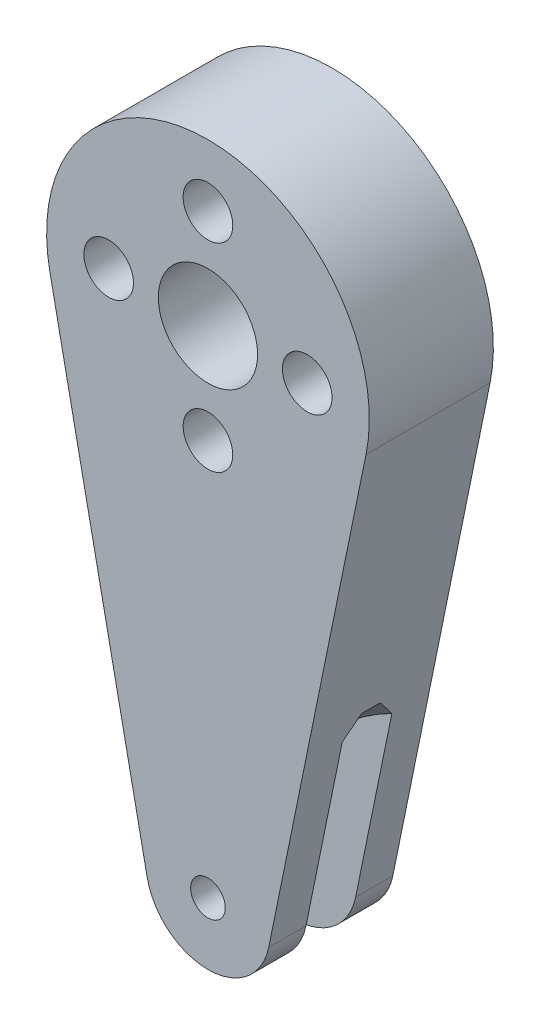
ISO-10303-21;
HEADER;
FILE_DESCRIPTION(('STEP AP214'),'2;1');
FILE_NAME('part.step','',(''),(''),'','','');
FILE_SCHEMA(('AUTOMOTIVE_DESIGN { 1 0 10303 214 1 1 1 1 }'));
ENDSEC;
DATA;
#1=APPLICATION_CONTEXT('core data for automotive mechanical design processes');
#2=APPLICATION_PROTOCOL_DEFINITION('international standard','automotive_design',2000,#1);
#3=PRODUCT_CONTEXT('',#1,'mechanical');
#4=PRODUCT('Part','Part','',(#3));
#5=PRODUCT_RELATED_PRODUCT_CATEGORY('part','',(#4));
#6=PRODUCT_DEFINITION_FORMATION('','',#4);
#7=PRODUCT_DEFINITION_CONTEXT('part definition',#1,'design');
#8=PRODUCT_DEFINITION('design','',#6,#7);
#9=PRODUCT_DEFINITION_SHAPE('','',#8);
#10=(LENGTH_UNIT() NAMED_UNIT(*) SI_UNIT(.MILLI.,.METRE.));
#11=(NAMED_UNIT(*) PLANE_ANGLE_UNIT() SI_UNIT($,.RADIAN.));
#12=(NAMED_UNIT(*) SI_UNIT($,.STERADIAN.) SOLID_ANGLE_UNIT());
#13=UNCERTAINTY_MEASURE_WITH_UNIT(LENGTH_MEASURE(1.E-05),#10,'distance_accuracy_value','');
#14=(GEOMETRIC_REPRESENTATION_CONTEXT(3) GLOBAL_UNCERTAINTY_ASSIGNED_CONTEXT((#13)) GLOBAL_UNIT_ASSIGNED_CONTEXT((#10,
#11,#12)) REPRESENTATION_CONTEXT('',''));
#15=CARTESIAN_POINT('',(0.,0.,0.));
#16=DIRECTION('',(0.,0.,1.));
#17=DIRECTION('',(1.,0.,0.));
#18=AXIS2_PLACEMENT_3D('',#15,#16,#17);
#19=CARTESIAN_POINT('',(4.89858223113876,-40.9243281720762,5.));
#20=DIRECTION('',(-0.979716446227753,0.200388834496492,0.));
#21=DIRECTION('',(-0.200388834496492,-0.979716446227753,0.));
#22=AXIS2_PLACEMENT_3D('',#19,#20,#21);
#23=PLANE('',#22);
#24=DIRECTION('',(0.200388834496492,0.979716446227753,0.));
#25=VECTOR('',#24,1.);
#26=CARTESIAN_POINT('',(4.89858223113876,-40.9243281720762,-2.));
#27=LINE('',#26,#25);
#28=CARTESIAN_POINT('',(4.89858223113876,-40.9243281720762,-2.));
#29=VERTEX_POINT('',#28);
#30=CARTESIAN_POINT('',(7.82050502514721,-26.6388225794583,-2.));
#31=VERTEX_POINT('',#30);
#32=EDGE_CURVE('E153',#29,#31,#27,.T.);
#33=ORIENTED_EDGE('',*,*,#32,.F.);
#34=DIRECTION('',(0.,0.,-1.));
#35=VECTOR('',#34,1.);
#36=CARTESIAN_POINT('',(4.89858223113876,-40.9243281720762,5.));
#37=LINE('',#36,#35);
#38=CARTESIAN_POINT('',(4.89858223113876,-40.9243281720762,-5.));
#39=VERTEX_POINT('',#38);
#40=EDGE_CURVE('E252',#29,#39,#37,.T.);
#41=ORIENTED_EDGE('',*,*,#40,.T.);
#42=DIRECTION('',(0.200388834496492,0.979716446227753,0.));
#43=VECTOR('',#42,1.);
#44=CARTESIAN_POINT('',(4.89858223113876,-40.9243281720762,-5.));
#45=LINE('',#44,#43);
#46=CARTESIAN_POINT('',(12.7363138009608,-2.6050548484544,-5.));
#47=VERTEX_POINT('',#46);
#48=EDGE_CURVE('E230',#39,#47,#45,.T.);
#49=ORIENTED_EDGE('',*,*,#48,.T.);
#50=DIRECTION('',(0.,0.,-1.));
#51=VECTOR('',#50,1.);
#52=CARTESIAN_POINT('',(12.7363138009608,-2.6050548484544,5.));
#53=LINE('',#52,#51);
#54=CARTESIAN_POINT('',(12.7363138009608,-2.6050548484544,5.));
#55=VERTEX_POINT('',#54);
#56=EDGE_CURVE('E248',#55,#47,#53,.T.);
#57=ORIENTED_EDGE('',*,*,#56,.F.);
#58=DIRECTION('',(0.200388834496492,0.979716446227753,0.));
#59=VECTOR('',#58,1.);
#60=CARTESIAN_POINT('',(4.89858223113876,-40.9243281720762,5.));
#61=LINE('',#60,#59);
#62=CARTESIAN_POINT('',(4.89858223113876,-40.9243281720762,5.));
#63=VERTEX_POINT('',#62);
#64=EDGE_CURVE('E216',#63,#55,#61,.T.);
#65=ORIENTED_EDGE('',*,*,#64,.F.);
#66=CARTESIAN_POINT('',(4.89858223113876,-40.9243281720762,2.));
#67=VERTEX_POINT('',#66);
#68=EDGE_CURVE('E49',#63,#67,#37,.T.);
#69=ORIENTED_EDGE('',*,*,#68,.T.);
#70=DIRECTION('',(0.200388834496492,0.979716446227753,0.));
#71=VECTOR('',#70,1.);
#72=CARTESIAN_POINT('',(4.89858223113876,-40.9243281720762,2.));
#73=LINE('',#72,#71);
#74=CARTESIAN_POINT('',(7.82050502514721,-26.6388225794583,2.));
#75=VERTEX_POINT('',#74);
#76=EDGE_CURVE('E147',#67,#75,#73,.T.);
#77=ORIENTED_EDGE('',*,*,#76,.T.);
#78=CARTESIAN_POINT('',(2.54787064978017,-52.417138150146,3.18919348340968));
#79=CARTESIAN_POINT('',(2.61122203467638,-52.1074083499299,3.4254755006891));
#80=CARTESIAN_POINT('',(2.67494999764639,-51.7958374305063,3.65928925034754));
#81=CARTESIAN_POINT('',(2.80331433153644,-51.1682543152237,4.12082368257699));
#82=CARTESIAN_POINT('',(2.8679509741202,-50.85224079118,4.34854248122842));
#83=CARTESIAN_POINT('',(2.99888327667946,-50.2121026792832,4.79876432339219));
#84=CARTESIAN_POINT('',(3.06518895962516,-49.8879290883569,5.02119505714001));
#85=CARTESIAN_POINT('',(3.19900812734369,-49.233676870344,5.45678619726294));
#86=CARTESIAN_POINT('',(3.26652151065638,-48.9035987393038,5.66994737726856));
#87=CARTESIAN_POINT('',(3.40685834069808,-48.2174811681887,6.09672681686181));
#88=CARTESIAN_POINT('',(3.47976445710841,-47.8610375496744,6.3096720796507));
#89=CARTESIAN_POINT('',(3.62740157770506,-47.1392282957522,6.71947364351095));
#90=CARTESIAN_POINT('',(3.70213292635973,-46.773860976212,6.91632687664895));
#91=CARTESIAN_POINT('',(3.85335404506874,-46.0345292794714,7.2888104323309));
#92=CARTESIAN_POINT('',(3.92983600908207,-45.6606030666066,7.4645189399616));
#93=CARTESIAN_POINT('',(4.08496394278756,-44.9021706504369,7.79000202141208));
#94=CARTESIAN_POINT('',(4.16360867529929,-44.5176704958024,7.93979107860555));
#95=CARTESIAN_POINT('',(4.31830512952786,-43.7613476160289,8.19892268058318));
#96=CARTESIAN_POINT('',(4.39422785412778,-43.3901555677301,8.31015753993367));
#97=CARTESIAN_POINT('',(4.54780216018444,-42.6393189567993,8.49816439320267));
#98=CARTESIAN_POINT('',(4.6254537790597,-42.2596742112253,8.57493564046171));
#99=CARTESIAN_POINT('',(4.78053355517448,-41.5014772412258,8.68785443858352));
#100=CARTESIAN_POINT('',(4.85794071308421,-41.1230276841411,8.72470631480975));
#101=CARTESIAN_POINT('',(5.01310429957934,-40.3644209587368,8.75744410162002));
#102=CARTESIAN_POINT('',(5.09086070076823,-39.9842639243609,8.75333317132062));
#103=CARTESIAN_POINT('',(5.24609948301341,-39.2252895611429,8.70439477897242));
#104=CARTESIAN_POINT('',(5.32358015680236,-38.8464805792624,8.65943527190226));
#105=CARTESIAN_POINT('',(5.47727765699252,-38.0950416627242,8.53193860319845));
#106=CARTESIAN_POINT('',(5.55349422740604,-37.7224129796101,8.44939392438089));
#107=CARTESIAN_POINT('',(5.70496369078655,-36.9818671066424,8.25085775867772));
#108=CARTESIAN_POINT('',(5.78019889964159,-36.6140363757742,8.13453464873539));
#109=CARTESIAN_POINT('',(5.89157650263925,-36.0695026961787,7.93956841424922));
#110=CARTESIAN_POINT('',(5.92845849607213,-35.8891837895557,7.87116173523214));
#111=CARTESIAN_POINT('',(6.00174027056452,-35.5309035497443,7.72817860048412));
#112=CARTESIAN_POINT('',(6.03814004333742,-35.3529422570696,7.65360203888743));
#113=CARTESIAN_POINT('',(6.16973469454727,-34.7095658716046,7.37217813499091));
#114=CARTESIAN_POINT('',(6.26352284882593,-34.2510283615731,7.14885782399688));
#115=CARTESIAN_POINT('',(6.44815658643967,-33.3483397974962,6.67361868085929));
#116=CARTESIAN_POINT('',(6.53900023309517,-32.9041982120265,6.42168149832004));
#117=CARTESIAN_POINT('',(6.71836414225712,-32.0272742451438,5.89590510638242));
#118=CARTESIAN_POINT('',(6.80687869731323,-31.5945197678951,5.6220177413341));
#119=CARTESIAN_POINT('',(6.98177902775288,-30.7394185811801,5.05813937837626));
#120=CARTESIAN_POINT('',(7.06816528202512,-30.31706953039,4.76815205178888));
#121=CARTESIAN_POINT('',(7.23984704162545,-29.4777041844095,4.17352547603728));
#122=CARTESIAN_POINT('',(7.32512942165296,-29.0607520598247,3.86879228119324));
#123=CARTESIAN_POINT('',(7.49424660132483,-28.2339251426439,3.24948081524676));
#124=CARTESIAN_POINT('',(7.57808133863509,-27.8240506548042,2.93490212183881));
#125=CARTESIAN_POINT('',(7.74443696092166,-27.0107252043812,2.29838206077673));
#126=CARTESIAN_POINT('',(7.82695947522308,-26.6072662759019,1.97645126964047));
#127=CARTESIAN_POINT('',(7.99100461819643,-25.8052369367993,1.32633437748087));
#128=CARTESIAN_POINT('',(8.07252726318894,-25.4066664463833,0.998148378783398));
#129=CARTESIAN_POINT('',(8.26633710925058,-24.4591151813412,0.207813451957313));
#130=CARTESIAN_POINT('',(8.3782351997857,-23.912036798086,-0.256709676451612));
#131=CARTESIAN_POINT('',(8.60075294164405,-22.8241304193506,-1.19331916782502));
#132=CARTESIAN_POINT('',(8.71137256809565,-22.2833025454697,-1.66540567750496));
#133=CARTESIAN_POINT('',(8.93163841062119,-21.2064058760185,-2.61576941450788));
#134=CARTESIAN_POINT('',(9.04128408772304,-20.6703397155242,-3.0940497484632));
#135=CARTESIAN_POINT('',(9.25973497408555,-19.6023165065458,-4.05536801579259));
#136=CARTESIAN_POINT('',(9.36854017756666,-19.0703594863184,-4.53840598183085));
#137=CARTESIAN_POINT('',(9.5823346936954,-18.0251016300564,-5.49438319820764));
#138=CARTESIAN_POINT('',(9.687343693535,-17.5117045418241,-5.96721290759863));
#139=CARTESIAN_POINT('',(9.89681340887739,-16.4875909697119,-6.91588959607166));
#140=CARTESIAN_POINT('',(10.0012741220973,-15.9768744969933,-7.39173658769839));
#141=CARTESIAN_POINT('',(10.2096502868137,-14.9581073781195,-8.34557459744458));
#142=CARTESIAN_POINT('',(10.313566102326,-14.4500549522625,-8.82356363656791));
#143=CARTESIAN_POINT('',(10.5209991766415,-13.4358986749973,-9.78167704479968));
#144=CARTESIAN_POINT('',(10.6245164408052,-12.929794797381,-10.2618013849996));
#145=CARTESIAN_POINT('',(10.7278678603777,-12.4245017467447,-10.7428099780698));
#146=B_SPLINE_CURVE_WITH_KNOTS('',3,(#78,#79,#80,#81,#82,#83,#84,#85,#86,#87,#88,#89,#90,#91,
#92,#93,#94,#95,#96,#97,#98,#99,#100,#101,#102,#103,#104,#105,#106,#107,#108,#109,#110,#111,
#112,#113,#114,#115,#116,#117,#118,#119,#120,#121,#122,#123,#124,#125,#126,#127,#128,#129,#130,
#131,#132,#133,#134,#135,#136,#137,#138,#139,#140,#141,#142,#143,#144,#145),.UNSPECIFIED.,.F.,
.F.,(4,2,2,2,2,2,2,2,2,2,2,2,2,2,2,2,2,2,2,2,2,2,2,2,2,2,2,2,2,2,2,2,2,4),(0.,1.18407965483998,
2.36852117241573,3.56448751074319,4.76035384223,6.02470925697247,7.28930516066317,
8.54907119753148,9.80813100805596,10.991379908498,12.1746544429728,13.3366933898072,
14.4986427190505,15.6643615219707,16.8303135757698,18.0081236014013,18.5970936070646,
19.18607372065,20.7402990854486,22.2955267749846,23.8542650744612,25.4126493785569,
26.982777295011,28.5529726519169,30.1210360902605,31.6890738994042,33.8680579757518,
36.047084371617,38.22724963958,40.4074298862209,42.5248538039449,44.6422865308776,
46.7580550911792,48.8737950940603),.UNSPECIFIED.);
#147=CARTESIAN_POINT('',(8.13335771711874,-25.1092616718295,0.750000000000008));
#148=VERTEX_POINT('',#147);
#149=EDGE_CURVE('E144',#75,#148,#146,.T.);
#150=ORIENTED_EDGE('',*,*,#149,.T.);
#151=DIRECTION('',(0.,0.,-1.));
#152=VECTOR('',#151,1.);
#153=CARTESIAN_POINT('',(8.13335771711874,-25.1092616718295,55.7401153701776));
#154=LINE('',#153,#152);
#155=CARTESIAN_POINT('',(8.13335771711874,-25.1092616718295,-0.749999999999994));
#156=VERTEX_POINT('',#155);
#157=EDGE_CURVE('E137',#156,#148,#154,.F.);
#158=ORIENTED_EDGE('',*,*,#157,.F.);
#159=CARTESIAN_POINT('',(10.7278678603777,-12.4245017467448,10.7428099780698));
#160=CARTESIAN_POINT('',(10.6467371757962,-12.8211559125216,10.3652059789838));
#161=CARTESIAN_POINT('',(10.5655028541999,-13.2183167676465,9.98815628292026));
#162=CARTESIAN_POINT('',(10.4027974695486,-14.0137959251213,9.23532865642005));
#163=CARTESIAN_POINT('',(10.3213264057411,-14.4121142311511,8.85955073003485));
#164=CARTESIAN_POINT('',(10.0764952037797,-15.6091128349602,7.7342834553306));
#165=CARTESIAN_POINT('',(9.9127363995912,-16.4097422416895,6.98695078936814));
#166=CARTESIAN_POINT('',(9.58506260960599,-18.0117646390597,5.50535631935859));
#167=CARTESIAN_POINT('',(9.42115778584001,-18.8131079467498,4.77103868479041));
#168=CARTESIAN_POINT('',(9.17395426051857,-20.0217050221879,3.67717891013584));
#169=CARTESIAN_POINT('',(9.09133071021555,-20.425657923461,3.31383709175939));
#170=CARTESIAN_POINT('',(8.92555741351191,-21.2361363392571,2.59015592768001));
#171=CARTESIAN_POINT('',(8.84240766885555,-21.6426618452523,2.22981657203356));
#172=CARTESIAN_POINT('',(8.64428578325912,-22.6112950037024,1.37861544244773));
#173=CARTESIAN_POINT('',(8.52904078634023,-23.1747366700537,0.889332262832018));
#174=CARTESIAN_POINT('',(8.29709776860761,-24.3087239484932,-0.0805809854174819));
#175=CARTESIAN_POINT('',(8.18039978911192,-24.8792693585744,-0.561211299163896));
#176=CARTESIAN_POINT('',(8.00355899232906,-25.7438576347002,-1.27516824560783));
#177=CARTESIAN_POINT('',(7.9441100551827,-26.0345080672924,-1.51277649589932));
#178=CARTESIAN_POINT('',(7.82467436149833,-26.6184383729065,-1.98459984193268));
#179=CARTESIAN_POINT('',(7.76468761173307,-26.911718212816,-2.21881498030754));
#180=CARTESIAN_POINT('',(7.64410969484056,-27.5012329356712,-2.68324294049522));
#181=CARTESIAN_POINT('',(7.58351862603931,-27.7974673378935,-2.91345639720903));
#182=CARTESIAN_POINT('',(7.46163290900041,-28.3933759963939,-3.36920599210989));
#183=CARTESIAN_POINT('',(7.40033825993649,-28.6930502567118,-3.59474212480309));
#184=CARTESIAN_POINT('',(7.27619427630119,-29.2999997545385,-4.04294462961691));
#185=CARTESIAN_POINT('',(7.21333510451404,-29.607323086953,-4.26554329516405));
#186=CARTESIAN_POINT('',(7.08666074939989,-30.2266437658345,-4.70388792855144));
#187=CARTESIAN_POINT('',(7.02284555341866,-30.5386411741689,-4.91963380556787));
#188=CARTESIAN_POINT('',(6.89404470847188,-31.1683584256288,-5.3430263653325));
#189=CARTESIAN_POINT('',(6.82905789289294,-31.486083972417,-5.55066424005962));
#190=CARTESIAN_POINT('',(6.69781370051501,-32.1277469376597,-5.95571511042172));
#191=CARTESIAN_POINT('',(6.63155635477498,-32.4516842042644,-6.15312835556918));
#192=CARTESIAN_POINT('',(6.49813901031447,-33.1039718774196,-6.53375261787586));
#193=CARTESIAN_POINT('',(6.43099094671371,-33.4322639322505,-6.71706724951765));
#194=CARTESIAN_POINT('',(6.29507408865514,-34.0967719199044,-7.0683071687173));
#195=CARTESIAN_POINT('',(6.22630506723635,-34.4329889623572,-7.23623028492243));
#196=CARTESIAN_POINT('',(6.08714147800316,-35.1133704687941,-7.55257775856541));
#197=CARTESIAN_POINT('',(6.01675048893161,-35.4575174360286,-7.70104096196395));
#198=CARTESIAN_POINT('',(5.87415185606057,-36.1546931353853,-7.97428709734733));
#199=CARTESIAN_POINT('',(5.80194483447173,-36.5077188254715,-8.09907801806898));
#200=CARTESIAN_POINT('',(5.65666420542103,-37.2180070107235,-8.31852841987746));
#201=CARTESIAN_POINT('',(5.58361234503989,-37.5751631827367,-8.41354131272123));
#202=CARTESIAN_POINT('',(5.43608163759328,-38.2964521745721,-8.57050658026859));
#203=CARTESIAN_POINT('',(5.36160299929003,-38.6605839737399,-8.63246375389447));
#204=CARTESIAN_POINT('',(5.21211891284543,-39.39142318595,-8.71913630227757));
#205=CARTESIAN_POINT('',(5.13711759464357,-39.7581104073999,-8.7440256046965));
#206=CARTESIAN_POINT('',(4.98699692233352,-40.4920619369374,-8.75532027628153));
#207=CARTESIAN_POINT('',(4.91187756980199,-40.8593262373164,-8.74172615520559));
#208=CARTESIAN_POINT('',(4.76281725095625,-41.5880936170961,-8.67727506099706));
#209=CARTESIAN_POINT('',(4.68887173543132,-41.9496189379385,-8.62667449500487));
#210=CARTESIAN_POINT('',(4.54223295549458,-42.66654722748,-8.49183392999524));
#211=CARTESIAN_POINT('',(4.46953990308713,-43.0219491596736,-8.40758829311476));
#212=CARTESIAN_POINT('',(4.3248707736643,-43.729247676146,-8.20885428923772));
#213=CARTESIAN_POINT('',(4.25291531318919,-44.0810434645714,-8.09399777664723));
#214=CARTESIAN_POINT('',(4.11080340277868,-44.7758395403302,-7.83962531902437));
#215=CARTESIAN_POINT('',(4.04064686133464,-45.1188402750562,-7.70011063118154));
#216=CARTESIAN_POINT('',(3.90599771076783,-45.7771503431414,-7.40945818100977));
#217=CARTESIAN_POINT('',(3.84140880620787,-46.0929304723099,-7.25941957062306));
#218=CARTESIAN_POINT('',(3.7136698411119,-46.7174561113909,-6.94471178342739));
#219=CARTESIAN_POINT('',(3.65052010612088,-47.026200029689,-6.78003933686904));
#220=CARTESIAN_POINT('',(3.52543394894128,-47.6377558865421,-6.43849435409161));
#221=CARTESIAN_POINT('',(3.463499660806,-47.9405573915461,-6.26160246321668));
#222=CARTESIAN_POINT('',(3.3408077057391,-48.5404078098636,-5.89802806031641));
#223=CARTESIAN_POINT('',(3.28004994418758,-48.837457185781,-5.71134634013452));
#224=CARTESIAN_POINT('',(3.16208025018634,-49.4142201060299,-5.33785615521328));
#225=CARTESIAN_POINT('',(3.10482615694957,-49.6941397776966,-5.15137810206903));
#226=CARTESIAN_POINT('',(2.99115055950589,-50.2499085291351,-4.77219164461401));
#227=CARTESIAN_POINT('',(2.93472909395366,-50.5257574199213,-4.57948295236333));
#228=CARTESIAN_POINT('',(2.82286375263536,-51.0726756897331,-4.18967171286369));
#229=CARTESIAN_POINT('',(2.76741670321528,-51.3437605849976,-3.99259178587315));
#230=CARTESIAN_POINT('',(2.65717663215246,-51.8827327833485,-3.59402096028435));
#231=CARTESIAN_POINT('',(2.60238350160066,-52.1506206188998,-3.39253081250118));
#232=CARTESIAN_POINT('',(2.54787064978017,-52.417138150146,-3.18919348340968));
#233=B_SPLINE_CURVE_WITH_KNOTS('',3,(#159,#160,#161,#162,#163,#164,#165,#166,#167,#168,#169,
#170,#171,#172,#173,#174,#175,#176,#177,#178,#179,#180,#181,#182,#183,#184,#185,#186,#187,#188,
#189,#190,#191,#192,#193,#194,#195,#196,#197,#198,#199,#200,#201,#202,#203,#204,#205,#206,#207,
#208,#209,#210,#211,#212,#213,#214,#215,#216,#217,#218,#219,#220,#221,#222,#223,#224,#225,#226,
#227,#228,#229,#230,#231,#232),.UNSPECIFIED.,.F.,.F.,(4,2,2,2,2,2,2,2,2,2,2,2,2,2,2,2,2,2,2,2,2,
2,2,2,2,2,2,2,2,2,2,2,2,2,2,2,4),(0.,1.66087671502154,3.32175871618519,6.64391901739653,
9.94144534490465,11.5901290848909,13.2388073626057,15.5039863501922,17.7691010700095,
18.9093558919021,20.0495963745341,21.1896542658975,22.3297134962683,23.4835622029136,
24.6374261957831,25.7925106497598,26.9475669028235,28.0931063353154,29.2388071264508,
30.3821848559089,31.525176038058,32.6540376760767,33.7827353849928,34.9061202143977,
36.0294901633258,37.1451494675961,38.2609958000143,39.3909201314486,40.5207868706459,
41.5869365633856,42.6533250759148,43.7214432106941,44.789475084344,45.8129355181694,
46.8364433175248,47.8555224025716,48.8744293242276),.UNSPECIFIED.);
#234=EDGE_CURVE('E120',#156,#31,#233,.T.);
#235=ORIENTED_EDGE('',*,*,#234,.T.);
#236=EDGE_LOOP('',(#33,#41,#49,#57,#65,#69,#77,#150,#158,#235));
#237=FACE_BOUND('',#236,.T.);
#238=ADVANCED_FACE('F40',(#237),#23,.F.);
#239=CARTESIAN_POINT('',(0.,-39.9223839995937,5.));
#240=DIRECTION('',(0.,0.,-1.));
#241=DIRECTION('',(-1.,0.,0.));
#242=AXIS2_PLACEMENT_3D('',#239,#240,#241);
#243=CYLINDRICAL_SURFACE('',#242,5.);
#244=CARTESIAN_POINT('',(0.,-39.9223839995937,-2.));
#245=DIRECTION('',(0.,0.,1.));
#246=DIRECTION('',(1.,0.,0.));
#247=AXIS2_PLACEMENT_3D('',#244,#245,#246);
#248=CIRCLE('',#247,5.);
#249=CARTESIAN_POINT('',(-4.89858223113876,-40.9243281720762,-2.));
#250=VERTEX_POINT('',#249);
#251=EDGE_CURVE('E151',#250,#29,#248,.T.);
#252=ORIENTED_EDGE('',*,*,#251,.F.);
#253=DIRECTION('',(0.,0.,-1.));
#254=VECTOR('',#253,1.);
#255=CARTESIAN_POINT('',(-4.89858223113876,-40.9243281720762,5.));
#256=LINE('',#255,#254);
#257=CARTESIAN_POINT('',(-4.89858223113876,-40.9243281720762,-5.));
#258=VERTEX_POINT('',#257);
#259=EDGE_CURVE('E226',#250,#258,#256,.T.);
#260=ORIENTED_EDGE('',*,*,#259,.T.);
#261=CARTESIAN_POINT('',(0.,-39.9223839995937,-5.));
#262=DIRECTION('',(0.,0.,1.));
#263=DIRECTION('',(-1.,0.,0.));
#264=AXIS2_PLACEMENT_3D('',#261,#262,#263);
#265=CIRCLE('',#264,5.);
#266=EDGE_CURVE('E208',#258,#39,#265,.T.);
#267=ORIENTED_EDGE('',*,*,#266,.T.);
#268=ORIENTED_EDGE('',*,*,#40,.F.);
#269=EDGE_LOOP('',(#252,#260,#267,#268));
#270=FACE_BOUND('',#269,.T.);
#271=ADVANCED_FACE('F284',(#270),#243,.T.);
#272=CARTESIAN_POINT('',(0.,-39.9223839995937,5.));
#273=DIRECTION('',(0.,0.,-1.));
#274=DIRECTION('',(-1.,0.,0.));
#275=AXIS2_PLACEMENT_3D('',#272,#273,#274);
#276=CYLINDRICAL_SURFACE('',#275,1.395);
#277=CARTESIAN_POINT('',(0.,-39.9223839995937,-5.));
#278=DIRECTION('',(0.,0.,1.));
#279=DIRECTION('',(1.,0.,0.));
#280=AXIS2_PLACEMENT_3D('',#277,#278,#279);
#281=CIRCLE('',#280,1.395);
#282=CARTESIAN_POINT('',(1.395,-39.9223839995937,-5.));
#283=VERTEX_POINT('',#282);
#284=EDGE_CURVE('E167',#283,#283,#281,.T.);
#285=ORIENTED_EDGE('',*,*,#284,.F.);
#286=EDGE_LOOP('',(#285));
#287=FACE_BOUND('',#286,.T.);
#288=CARTESIAN_POINT('',(0.,-39.9223839995937,-2.));
#289=DIRECTION('',(0.,0.,1.));
#290=DIRECTION('',(1.,0.,0.));
#291=AXIS2_PLACEMENT_3D('',#288,#289,#290);
#292=CIRCLE('',#291,1.395);
#293=CARTESIAN_POINT('',(1.395,-39.9223839995937,-2.));
#294=VERTEX_POINT('',#293);
#295=EDGE_CURVE('E159',#294,#294,#292,.T.);
#296=ORIENTED_EDGE('',*,*,#295,.T.);
#297=EDGE_LOOP('',(#296));
#298=FACE_BOUND('',#297,.T.);
#299=ADVANCED_FACE('F270',(#287,#298),#276,.F.);
#300=CARTESIAN_POINT('',(0.,-39.9223839995937,5.));
#301=DIRECTION('',(0.,0.,-1.));
#302=DIRECTION('',(-1.,0.,0.));
#303=AXIS2_PLACEMENT_3D('',#300,#301,#302);
#304=PLANE('',#303);
#305=CARTESIAN_POINT('',(0.,-39.9223839995937,5.));
#306=DIRECTION('',(0.,0.,1.));
#307=DIRECTION('',(-1.,0.,0.));
#308=AXIS2_PLACEMENT_3D('',#305,#306,#307);
#309=CIRCLE('',#308,5.);
#310=CARTESIAN_POINT('',(-4.89858223113876,-40.9243281720762,5.));
#311=VERTEX_POINT('',#310);
#312=EDGE_CURVE('E212',#311,#63,#309,.T.);
#313=ORIENTED_EDGE('',*,*,#312,.T.);
#314=ORIENTED_EDGE('',*,*,#64,.T.);
#315=CARTESIAN_POINT('',(0.,0.,5.));
#316=DIRECTION('',(0.,0.,1.));
#317=DIRECTION('',(-1.,0.,0.));
#318=AXIS2_PLACEMENT_3D('',#315,#316,#317);
#319=CIRCLE('',#318,13.);
#320=CARTESIAN_POINT('',(-12.7363138009608,-2.6050548484544,5.));
#321=VERTEX_POINT('',#320);
#322=EDGE_CURVE('E220',#55,#321,#319,.T.);
#323=ORIENTED_EDGE('',*,*,#322,.T.);
#324=DIRECTION('',(0.200388834496492,-0.979716446227753,0.));
#325=VECTOR('',#324,1.);
#326=CARTESIAN_POINT('',(-4.89858223113876,-40.9243281720762,5.));
#327=LINE('',#326,#325);
#328=EDGE_CURVE('E223',#321,#311,#327,.T.);
#329=ORIENTED_EDGE('',*,*,#328,.T.);
#330=EDGE_LOOP('',(#313,#314,#323,#329));
#331=FACE_BOUND('',#330,.T.);
#332=CARTESIAN_POINT('',(0.,0.,5.));
#333=DIRECTION('',(0.,0.,1.));
#334=DIRECTION('',(1.,0.,0.));
#335=AXIS2_PLACEMENT_3D('',#332,#333,#334);
#336=CIRCLE('',#335,4.);
#337=CARTESIAN_POINT('',(4.,0.,5.));
#338=VERTEX_POINT('',#337);
#339=EDGE_CURVE('E204',#338,#338,#336,.T.);
#340=ORIENTED_EDGE('',*,*,#339,.F.);
#341=EDGE_LOOP('',(#340));
#342=FACE_BOUND('',#341,.T.);
#343=CARTESIAN_POINT('',(0.,8.,5.));
#344=DIRECTION('',(0.,0.,1.));
#345=DIRECTION('',(1.,0.,0.));
#346=AXIS2_PLACEMENT_3D('',#343,#344,#345);
#347=CIRCLE('',#346,2.);
#348=CARTESIAN_POINT('',(2.,8.,5.));
#349=VERTEX_POINT('',#348);
#350=EDGE_CURVE('E196',#349,#349,#347,.T.);
#351=ORIENTED_EDGE('',*,*,#350,.F.);
#352=EDGE_LOOP('',(#351));
#353=FACE_BOUND('',#352,.T.);
#354=CARTESIAN_POINT('',(8.,0.,5.));
#355=DIRECTION('',(0.,0.,1.));
#356=DIRECTION('',(1.,0.,0.));
#357=AXIS2_PLACEMENT_3D('',#354,#355,#356);
#358=CIRCLE('',#357,2.);
#359=CARTESIAN_POINT('',(10.,0.,5.));
#360=VERTEX_POINT('',#359);
#361=EDGE_CURVE('E188',#360,#360,#358,.T.);
#362=ORIENTED_EDGE('',*,*,#361,.F.);
#363=EDGE_LOOP('',(#362));
#364=FACE_BOUND('',#363,.T.);
#365=CARTESIAN_POINT('',(0.,-8.,5.));
#366=DIRECTION('',(0.,0.,1.));
#367=DIRECTION('',(1.,0.,0.));
#368=AXIS2_PLACEMENT_3D('',#365,#366,#367);
#369=CIRCLE('',#368,2.);
#370=CARTESIAN_POINT('',(2.,-8.,5.));
#371=VERTEX_POINT('',#370);
#372=EDGE_CURVE('E180',#371,#371,#369,.T.);
#373=ORIENTED_EDGE('',*,*,#372,.F.);
#374=EDGE_LOOP('',(#373));
#375=FACE_BOUND('',#374,.T.);
#376=CARTESIAN_POINT('',(-8.,0.,5.));
#377=DIRECTION('',(0.,0.,1.));
#378=DIRECTION('',(1.,0.,0.));
#379=AXIS2_PLACEMENT_3D('',#376,#377,#378);
#380=CIRCLE('',#379,2.);
#381=CARTESIAN_POINT('',(-6.,0.,5.));
#382=VERTEX_POINT('',#381);
#383=EDGE_CURVE('E172',#382,#382,#380,.T.);
#384=ORIENTED_EDGE('',*,*,#383,.F.);
#385=EDGE_LOOP('',(#384));
#386=FACE_BOUND('',#385,.T.);
#387=CARTESIAN_POINT('',(0.,-39.9223839995937,5.));
#388=DIRECTION('',(0.,0.,1.));
#389=DIRECTION('',(1.,0.,0.));
#390=AXIS2_PLACEMENT_3D('',#387,#388,#389);
#391=CIRCLE('',#390,1.395);
#392=CARTESIAN_POINT('',(1.395,-39.9223839995937,5.));
#393=VERTEX_POINT('',#392);
#394=EDGE_CURVE('E162',#393,#393,#391,.T.);
#395=ORIENTED_EDGE('',*,*,#394,.F.);
#396=EDGE_LOOP('',(#395));
#397=FACE_BOUND('',#396,.T.);
#398=ADVANCED_FACE('F273',(#331,#342,#353,#364,#375,#386,#397),#304,.F.);
#399=CARTESIAN_POINT('',(0.,-39.9223839995937,-5.));
#400=DIRECTION('',(0.,0.,-1.));
#401=DIRECTION('',(-1.,0.,0.));
#402=AXIS2_PLACEMENT_3D('',#399,#400,#401);
#403=PLANE('',#402);
#404=CARTESIAN_POINT('',(-8.,0.,-5.));
#405=DIRECTION('',(0.,0.,1.));
#406=DIRECTION('',(1.,0.,0.));
#407=AXIS2_PLACEMENT_3D('',#404,#405,#406);
#408=CIRCLE('',#407,2.);
#409=CARTESIAN_POINT('',(-6.,0.,-5.));
#410=VERTEX_POINT('',#409);
#411=EDGE_CURVE('E166',#410,#410,#408,.T.);
#412=ORIENTED_EDGE('',*,*,#411,.T.);
#413=EDGE_LOOP('',(#412));
#414=FACE_BOUND('',#413,.T.);
#415=CARTESIAN_POINT('',(8.,0.,-5.));
#416=DIRECTION('',(0.,0.,1.));
#417=DIRECTION('',(1.,0.,0.));
#418=AXIS2_PLACEMENT_3D('',#415,#416,#417);
#419=CIRCLE('',#418,2.);
#420=CARTESIAN_POINT('',(10.,0.,-5.));
#421=VERTEX_POINT('',#420);
#422=EDGE_CURVE('E184',#421,#421,#419,.T.);
#423=ORIENTED_EDGE('',*,*,#422,.T.);
#424=EDGE_LOOP('',(#423));
#425=FACE_BOUND('',#424,.T.);
#426=CARTESIAN_POINT('',(0.,0.,-5.));
#427=DIRECTION('',(0.,0.,1.));
#428=DIRECTION('',(1.,0.,0.));
#429=AXIS2_PLACEMENT_3D('',#426,#427,#428);
#430=CIRCLE('',#429,4.);
#431=CARTESIAN_POINT('',(4.,0.,-5.));
#432=VERTEX_POINT('',#431);
#433=EDGE_CURVE('E200',#432,#432,#430,.T.);
#434=ORIENTED_EDGE('',*,*,#433,.T.);
#435=EDGE_LOOP('',(#434));
#436=FACE_BOUND('',#435,.T.);
#437=ORIENTED_EDGE('',*,*,#266,.F.);
#438=DIRECTION('',(0.200388834496492,-0.979716446227753,0.));
#439=VECTOR('',#438,1.);
#440=CARTESIAN_POINT('',(-4.89858223113876,-40.9243281720762,-5.));
#441=LINE('',#440,#439);
#442=CARTESIAN_POINT('',(-12.7363138009608,-2.6050548484544,-5.));
#443=VERTEX_POINT('',#442);
#444=EDGE_CURVE('E217',#443,#258,#441,.T.);
#445=ORIENTED_EDGE('',*,*,#444,.F.);
#446=CARTESIAN_POINT('',(0.,0.,-5.));
#447=DIRECTION('',(0.,0.,1.));
#448=DIRECTION('',(-1.,0.,0.));
#449=AXIS2_PLACEMENT_3D('',#446,#447,#448);
#450=CIRCLE('',#449,13.);
#451=EDGE_CURVE('E233',#47,#443,#450,.T.);
#452=ORIENTED_EDGE('',*,*,#451,.F.);
#453=ORIENTED_EDGE('',*,*,#48,.F.);
#454=EDGE_LOOP('',(#437,#445,#452,#453));
#455=FACE_BOUND('',#454,.T.);
#456=CARTESIAN_POINT('',(0.,8.,-5.));
#457=DIRECTION('',(0.,0.,1.));
#458=DIRECTION('',(1.,0.,0.));
#459=AXIS2_PLACEMENT_3D('',#456,#457,#458);
#460=CIRCLE('',#459,2.);
#461=CARTESIAN_POINT('',(2.,8.,-5.));
#462=VERTEX_POINT('',#461);
#463=EDGE_CURVE('E192',#462,#462,#460,.T.);
#464=ORIENTED_EDGE('',*,*,#463,.T.);
#465=EDGE_LOOP('',(#464));
#466=FACE_BOUND('',#465,.T.);
#467=CARTESIAN_POINT('',(0.,-8.,-5.));
#468=DIRECTION('',(0.,0.,1.));
#469=DIRECTION('',(1.,0.,0.));
#470=AXIS2_PLACEMENT_3D('',#467,#468,#469);
#471=CIRCLE('',#470,2.);
#472=CARTESIAN_POINT('',(2.,-8.,-5.));
#473=VERTEX_POINT('',#472);
#474=EDGE_CURVE('E176',#473,#473,#471,.T.);
#475=ORIENTED_EDGE('',*,*,#474,.T.);
#476=EDGE_LOOP('',(#475));
#477=FACE_BOUND('',#476,.T.);
#478=ORIENTED_EDGE('',*,*,#284,.T.);
#479=EDGE_LOOP('',(#478));
#480=FACE_BOUND('',#479,.T.);
#481=ADVANCED_FACE('F275',(#414,#425,#436,#455,#466,#477,#480),#403,.T.);
#482=CARTESIAN_POINT('',(-4.89858223113876,-40.9243281720762,2.));
#483=VERTEX_POINT('',#482);
#484=EDGE_CURVE('E239',#311,#483,#256,.T.);
#485=ORIENTED_EDGE('',*,*,#484,.T.);
#486=CARTESIAN_POINT('',(0.,-39.9223839995937,2.));
#487=DIRECTION('',(0.,0.,1.));
#488=DIRECTION('',(1.,0.,0.));
#489=AXIS2_PLACEMENT_3D('',#486,#487,#488);
#490=CIRCLE('',#489,5.);
#491=EDGE_CURVE('E157',#483,#67,#490,.T.);
#492=ORIENTED_EDGE('',*,*,#491,.T.);
#493=ORIENTED_EDGE('',*,*,#68,.F.);
#494=ORIENTED_EDGE('',*,*,#312,.F.);
#495=EDGE_LOOP('',(#485,#492,#493,#494));
#496=FACE_BOUND('',#495,.T.);
#497=ADVANCED_FACE('F42',(#496),#243,.T.);
#498=CARTESIAN_POINT('',(0.,0.,5.));
#499=DIRECTION('',(0.,0.,-1.));
#500=DIRECTION('',(-1.,0.,0.));
#501=AXIS2_PLACEMENT_3D('',#498,#499,#500);
#502=CYLINDRICAL_SURFACE('',#501,13.);
#503=ORIENTED_EDGE('',*,*,#451,.T.);
#504=DIRECTION('',(0.,0.,-1.));
#505=VECTOR('',#504,1.);
#506=CARTESIAN_POINT('',(-12.7363138009608,-2.6050548484544,5.));
#507=LINE('',#506,#505);
#508=EDGE_CURVE('E243',#321,#443,#507,.T.);
#509=ORIENTED_EDGE('',*,*,#508,.F.);
#510=ORIENTED_EDGE('',*,*,#322,.F.);
#511=ORIENTED_EDGE('',*,*,#56,.T.);
#512=EDGE_LOOP('',(#503,#509,#510,#511));
#513=FACE_BOUND('',#512,.T.);
#514=ADVANCED_FACE('F295',(#513),#502,.T.);
#515=CARTESIAN_POINT('',(-4.89858223113876,-40.9243281720762,5.));
#516=DIRECTION('',(0.979716446227753,0.200388834496492,0.));
#517=DIRECTION('',(-0.200388834496492,0.979716446227753,0.));
#518=AXIS2_PLACEMENT_3D('',#515,#516,#517);
#519=PLANE('',#518);
#520=ORIENTED_EDGE('',*,*,#444,.T.);
#521=ORIENTED_EDGE('',*,*,#259,.F.);
#522=EDGE_CURVE('E244',#483,#250,#256,.T.);
#523=ORIENTED_EDGE('',*,*,#522,.F.);
#524=ORIENTED_EDGE('',*,*,#484,.F.);
#525=ORIENTED_EDGE('',*,*,#328,.F.);
#526=ORIENTED_EDGE('',*,*,#508,.T.);
#527=EDGE_LOOP('',(#520,#521,#523,#524,#525,#526));
#528=FACE_BOUND('',#527,.T.);
#529=ADVANCED_FACE('F360',(#528),#519,.F.);
#530=CARTESIAN_POINT('',(0.,0.,5.));
#531=DIRECTION('',(0.,0.,-1.));
#532=DIRECTION('',(-1.,0.,0.));
#533=AXIS2_PLACEMENT_3D('',#530,#531,#532);
#534=CYLINDRICAL_SURFACE('',#533,4.);
#535=ORIENTED_EDGE('',*,*,#339,.T.);
#536=EDGE_LOOP('',(#535));
#537=FACE_BOUND('',#536,.T.);
#538=ORIENTED_EDGE('',*,*,#433,.F.);
#539=EDGE_LOOP('',(#538));
#540=FACE_BOUND('',#539,.T.);
#541=ADVANCED_FACE('F382',(#537,#540),#534,.F.);
#542=CARTESIAN_POINT('',(0.,8.,5.));
#543=DIRECTION('',(0.,0.,-1.));
#544=DIRECTION('',(-1.,0.,0.));
#545=AXIS2_PLACEMENT_3D('',#542,#543,#544);
#546=CYLINDRICAL_SURFACE('',#545,2.);
#547=ORIENTED_EDGE('',*,*,#350,.T.);
#548=EDGE_LOOP('',(#547));
#549=FACE_BOUND('',#548,.T.);
#550=ORIENTED_EDGE('',*,*,#463,.F.);
#551=EDGE_LOOP('',(#550));
#552=FACE_BOUND('',#551,.T.);
#553=ADVANCED_FACE('F386',(#549,#552),#546,.F.);
#554=CARTESIAN_POINT('',(8.,0.,5.));
#555=DIRECTION('',(0.,0.,-1.));
#556=DIRECTION('',(-1.,0.,0.));
#557=AXIS2_PLACEMENT_3D('',#554,#555,#556);
#558=CYLINDRICAL_SURFACE('',#557,2.);
#559=ORIENTED_EDGE('',*,*,#361,.T.);
#560=EDGE_LOOP('',(#559));
#561=FACE_BOUND('',#560,.T.);
#562=ORIENTED_EDGE('',*,*,#422,.F.);
#563=EDGE_LOOP('',(#562));
#564=FACE_BOUND('',#563,.T.);
#565=ADVANCED_FACE('F391',(#561,#564),#558,.F.);
#566=CARTESIAN_POINT('',(0.,-8.,5.));
#567=DIRECTION('',(0.,0.,-1.));
#568=DIRECTION('',(-1.,0.,0.));
#569=AXIS2_PLACEMENT_3D('',#566,#567,#568);
#570=CYLINDRICAL_SURFACE('',#569,2.);
#571=ORIENTED_EDGE('',*,*,#372,.T.);
#572=EDGE_LOOP('',(#571));
#573=FACE_BOUND('',#572,.T.);
#574=ORIENTED_EDGE('',*,*,#474,.F.);
#575=EDGE_LOOP('',(#574));
#576=FACE_BOUND('',#575,.T.);
#577=ADVANCED_FACE('F398',(#573,#576),#570,.F.);
#578=CARTESIAN_POINT('',(-8.,0.,5.));
#579=DIRECTION('',(0.,0.,-1.));
#580=DIRECTION('',(-1.,0.,0.));
#581=AXIS2_PLACEMENT_3D('',#578,#579,#580);
#582=CYLINDRICAL_SURFACE('',#581,2.);
#583=ORIENTED_EDGE('',*,*,#383,.T.);
#584=EDGE_LOOP('',(#583));
#585=FACE_BOUND('',#584,.T.);
#586=ORIENTED_EDGE('',*,*,#411,.F.);
#587=EDGE_LOOP('',(#586));
#588=FACE_BOUND('',#587,.T.);
#589=ADVANCED_FACE('F268',(#585,#588),#582,.F.);
#590=CARTESIAN_POINT('',(0.,-39.9223839995937,2.));
#591=DIRECTION('',(0.,0.,1.));
#592=DIRECTION('',(1.,0.,0.));
#593=AXIS2_PLACEMENT_3D('',#590,#591,#592);
#594=CIRCLE('',#593,1.395);
#595=CARTESIAN_POINT('',(1.395,-39.9223839995937,2.));
#596=VERTEX_POINT('',#595);
#597=EDGE_CURVE('E171',#596,#596,#594,.T.);
#598=ORIENTED_EDGE('',*,*,#597,.F.);
#599=EDGE_LOOP('',(#598));
#600=FACE_BOUND('',#599,.T.);
#601=ORIENTED_EDGE('',*,*,#394,.T.);
#602=EDGE_LOOP('',(#601));
#603=FACE_BOUND('',#602,.T.);
#604=ADVANCED_FACE('F264',(#600,#603),#276,.F.);
#605=CARTESIAN_POINT('',(0.,-39.9223839995937,2.));
#606=DIRECTION('',(0.,0.,-1.));
#607=DIRECTION('',(-1.,0.,0.));
#608=AXIS2_PLACEMENT_3D('',#605,#606,#607);
#609=CYLINDRICAL_SURFACE('',#608,5.);
#610=CARTESIAN_POINT('',(-1.75774707464011,-35.2415373644652,-0.749799999999993));
#611=CARTESIAN_POINT('',(-1.63235315426675,-35.1944554105562,-0.847734468710089));
#612=CARTESIAN_POINT('',(-1.50644932356365,-35.1529181191776,-0.947608571631658));
#613=CARTESIAN_POINT('',(-1.25482562742197,-35.0806397144712,-1.15033746468261));
#614=CARTESIAN_POINT('',(-1.12910711240393,-35.0498551803488,-1.25317840788965));
#615=CARTESIAN_POINT('',(-0.878035262299784,-34.9984144907244,-1.46173954524986));
#616=CARTESIAN_POINT('',(-0.75268188966576,-34.9777572544408,-1.56745943089171));
#617=CARTESIAN_POINT('',(-0.502361215395289,-34.9460799937427,-1.78182831385822));
#618=CARTESIAN_POINT('',(-0.377397606778357,-34.9350998495196,-1.89048754767352));
#619=CARTESIAN_POINT('',(-0.253163654618858,-34.9287972962331,-2.0002));
#620=B_SPLINE_CURVE_WITH_KNOTS('',3,(#610,#611,#612,#613,#614,#615,#616,#617,#618,#619),
.UNSPECIFIED.,.F.,.F.,(4,2,2,2,4),(0.,0.497612116721919,0.993190938341248,1.48871686044961,
1.98627546835301),.UNSPECIFIED.);
#621=CARTESIAN_POINT('',(-1.75749100938612,-35.2414412150762,-0.749999999999994));
#622=VERTEX_POINT('',#621);
#623=CARTESIAN_POINT('',(-0.25339013621065,-34.9288087834914,-2.));
#624=VERTEX_POINT('',#623);
#625=EDGE_CURVE('E132',#622,#624,#620,.T.);
#626=ORIENTED_EDGE('',*,*,#625,.F.);
#627=DIRECTION('',(0.,0.,-1.));
#628=VECTOR('',#627,1.);
#629=CARTESIAN_POINT('',(-1.75749100938612,-35.2414412150762,0.));
#630=LINE('',#629,#628);
#631=CARTESIAN_POINT('',(-1.75749100938612,-35.2414412150762,0.750000000000008));
#632=VERTEX_POINT('',#631);
#633=EDGE_CURVE('E11',#622,#632,#630,.F.);
#634=ORIENTED_EDGE('',*,*,#633,.T.);
#635=CARTESIAN_POINT('',(-0.253163654618863,-34.9287972962331,2.0002));
#636=CARTESIAN_POINT('',(-0.377397606778364,-34.9350998495196,1.89048754767352));
#637=CARTESIAN_POINT('',(-0.502361215395295,-34.9460799937427,1.78182831385822));
#638=CARTESIAN_POINT('',(-0.752681889665762,-34.9777572544408,1.56745943089171));
#639=CARTESIAN_POINT('',(-0.878035262299786,-34.9984144907244,1.46173954524986));
#640=CARTESIAN_POINT('',(-1.12910711240393,-35.0498551803488,1.25317840788966));
#641=CARTESIAN_POINT('',(-1.25482562742197,-35.0806397144712,1.15033746468262));
#642=CARTESIAN_POINT('',(-1.50644932356365,-35.1529181191776,0.94760857163167));
#643=CARTESIAN_POINT('',(-1.63235315426675,-35.1944554105562,0.847734468710103));
#644=CARTESIAN_POINT('',(-1.75774707464011,-35.2415373644652,0.74980000000001));
#645=B_SPLINE_CURVE_WITH_KNOTS('',3,(#635,#636,#637,#638,#639,#640,#641,#642,#643,#644),
.UNSPECIFIED.,.F.,.F.,(4,2,2,2,4),(0.,0.497558607903391,0.993084530011751,1.48866335163108,
1.98627546835299),.UNSPECIFIED.);
#646=CARTESIAN_POINT('',(-0.253390136210655,-34.9288087834914,2.));
#647=VERTEX_POINT('',#646);
#648=EDGE_CURVE('E131',#647,#632,#645,.T.);
#649=ORIENTED_EDGE('',*,*,#648,.F.);
#650=EDGE_CURVE('E63',#647,#483,#490,.T.);
#651=ORIENTED_EDGE('',*,*,#650,.T.);
#652=ORIENTED_EDGE('',*,*,#522,.T.);
#653=EDGE_CURVE('E146',#624,#250,#248,.T.);
#654=ORIENTED_EDGE('',*,*,#653,.F.);
#655=EDGE_LOOP('',(#626,#634,#649,#651,#652,#654));
#656=FACE_BOUND('',#655,.T.);
#657=ADVANCED_FACE('F267',(#656),#609,.F.);
#658=CARTESIAN_POINT('',(0.,-39.9223839995937,2.));
#659=DIRECTION('',(0.,0.,1.));
#660=DIRECTION('',(1.,0.,0.));
#661=AXIS2_PLACEMENT_3D('',#658,#659,#660);
#662=PLANE('',#661);
#663=ORIENTED_EDGE('',*,*,#650,.F.);
#664=CARTESIAN_POINT('',(15.8047916747626,-42.4916982396271,2.));
#665=DIRECTION('',(0.,0.,1.));
#666=DIRECTION('',(1.,0.,0.));
#667=AXIS2_PLACEMENT_3D('',#664,#665,#666);
#668=CIRCLE('',#667,17.75);
#669=EDGE_CURVE('E56',#75,#647,#668,.T.);
#670=ORIENTED_EDGE('',*,*,#669,.F.);
#671=ORIENTED_EDGE('',*,*,#76,.F.);
#672=ORIENTED_EDGE('',*,*,#491,.F.);
#673=EDGE_LOOP('',(#663,#670,#671,#672));
#674=FACE_BOUND('',#673,.T.);
#675=ORIENTED_EDGE('',*,*,#597,.T.);
#676=EDGE_LOOP('',(#675));
#677=FACE_BOUND('',#676,.T.);
#678=ADVANCED_FACE('F262',(#674,#677),#662,.F.);
#679=CARTESIAN_POINT('',(0.,-39.9223839995937,-2.));
#680=DIRECTION('',(0.,0.,1.));
#681=DIRECTION('',(1.,0.,0.));
#682=AXIS2_PLACEMENT_3D('',#679,#680,#681);
#683=PLANE('',#682);
#684=ORIENTED_EDGE('',*,*,#251,.T.);
#685=ORIENTED_EDGE('',*,*,#32,.T.);
#686=CARTESIAN_POINT('',(15.8047916747626,-42.4916982396271,-2.));
#687=DIRECTION('',(0.,0.,1.));
#688=DIRECTION('',(1.,0.,0.));
#689=AXIS2_PLACEMENT_3D('',#686,#687,#688);
#690=CIRCLE('',#689,17.75);
#691=EDGE_CURVE('E126',#624,#31,#690,.F.);
#692=ORIENTED_EDGE('',*,*,#691,.F.);
#693=ORIENTED_EDGE('',*,*,#653,.T.);
#694=EDGE_LOOP('',(#684,#685,#692,#693));
#695=FACE_BOUND('',#694,.T.);
#696=ORIENTED_EDGE('',*,*,#295,.F.);
#697=EDGE_LOOP('',(#696));
#698=FACE_BOUND('',#697,.T.);
#699=ADVANCED_FACE('F326',(#695,#698),#683,.T.);
#700=CARTESIAN_POINT('',(15.8047916747626,-42.4916982396271,55.7401153701776));
#701=DIRECTION('',(0.,0.,-1.));
#702=DIRECTION('',(-1.,0.,0.));
#703=AXIS2_PLACEMENT_3D('',#700,#701,#702);
#704=CYLINDRICAL_SURFACE('',#703,19.);
#705=ORIENTED_EDGE('',*,*,#157,.T.);
#706=CARTESIAN_POINT('',(15.8047916747626,-42.4916982396271,0.750000000000008));
#707=DIRECTION('',(0.,0.,1.));
#708=DIRECTION('',(1.,0.,0.));
#709=AXIS2_PLACEMENT_3D('',#706,#707,#708);
#710=CIRCLE('',#709,19.);
#711=EDGE_CURVE('E140',#632,#148,#710,.F.);
#712=ORIENTED_EDGE('',*,*,#711,.F.);
#713=ORIENTED_EDGE('',*,*,#633,.F.);
#714=CARTESIAN_POINT('',(15.8047916747626,-42.4916982396271,-0.749999999999994));
#715=DIRECTION('',(0.,0.,1.));
#716=DIRECTION('',(1.,0.,0.));
#717=AXIS2_PLACEMENT_3D('',#714,#715,#716);
#718=CIRCLE('',#717,19.);
#719=EDGE_CURVE('E123',#156,#622,#718,.T.);
#720=ORIENTED_EDGE('',*,*,#719,.F.);
#721=EDGE_LOOP('',(#705,#712,#713,#720));
#722=FACE_BOUND('',#721,.T.);
#723=ADVANCED_FACE('F135',(#722),#704,.F.);
#724=CARTESIAN_POINT('',(15.8047916747626,-42.4916982396271,2.));
#725=DIRECTION('',(0.,0.,-1.));
#726=DIRECTION('',(-1.,0.,0.));
#727=AXIS2_PLACEMENT_3D('',#724,#725,#726);
#728=CONICAL_SURFACE('',#727,17.75,0.785398163397447);
#729=ORIENTED_EDGE('',*,*,#669,.T.);
#730=ORIENTED_EDGE('',*,*,#648,.T.);
#731=ORIENTED_EDGE('',*,*,#711,.T.);
#732=ORIENTED_EDGE('',*,*,#149,.F.);
#733=EDGE_LOOP('',(#729,#730,#731,#732));
#734=FACE_BOUND('',#733,.T.);
#735=ADVANCED_FACE('F317',(#734),#728,.F.);
#736=CARTESIAN_POINT('',(15.8047916747626,-42.4916982396271,-2.));
#737=DIRECTION('',(0.,0.,1.));
#738=DIRECTION('',(1.,0.,0.));
#739=AXIS2_PLACEMENT_3D('',#736,#737,#738);
#740=CONICAL_SURFACE('',#739,17.75,0.785398163397444);
#741=ORIENTED_EDGE('',*,*,#719,.T.);
#742=ORIENTED_EDGE('',*,*,#625,.T.);
#743=ORIENTED_EDGE('',*,*,#691,.T.);
#744=ORIENTED_EDGE('',*,*,#234,.F.);
#745=EDGE_LOOP('',(#741,#742,#743,#744));
#746=FACE_BOUND('',#745,.T.);
#747=ADVANCED_FACE('F122',(#746),#740,.F.);
#748=CLOSED_SHELL('',(#238,#271,#299,#398,#481,#497,#514,#529,#541,#553,#565,#577,#589,#604,
#657,#678,#699,#723,#735,#747));
#749=MANIFOLD_SOLID_BREP('B2',#748);
#750=ADVANCED_BREP_SHAPE_REPRESENTATION('',(#18,#749),#14);
#751=SHAPE_DEFINITION_REPRESENTATION(#9,#750);
ENDSEC;
END-ISO-10303-21;
